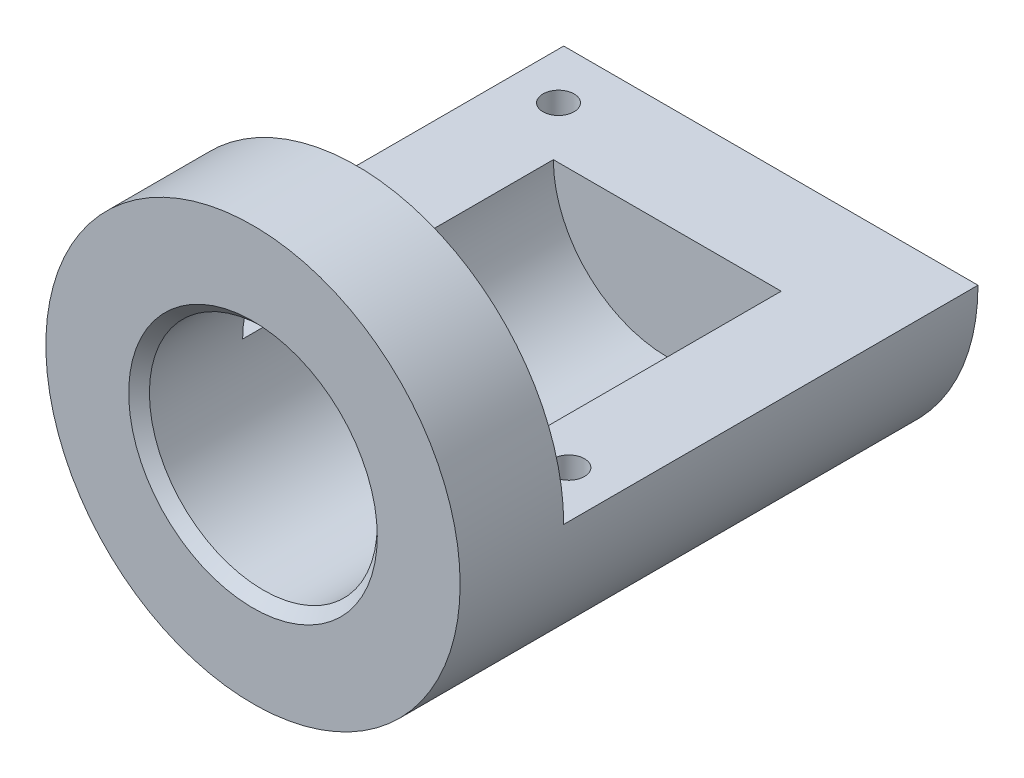
ISO-10303-21;
HEADER;
FILE_DESCRIPTION(('STEP AP214'),'2;1');
FILE_NAME('part.step','',(''),(''),'','','');
FILE_SCHEMA(('AUTOMOTIVE_DESIGN { 1 0 10303 214 1 1 1 1 }'));
ENDSEC;
DATA;
#1=APPLICATION_CONTEXT('core data for automotive mechanical design processes');
#2=APPLICATION_PROTOCOL_DEFINITION('international standard','automotive_design',2000,#1);
#3=PRODUCT_CONTEXT('',#1,'mechanical');
#4=PRODUCT('Part','Part','',(#3));
#5=PRODUCT_RELATED_PRODUCT_CATEGORY('part','',(#4));
#6=PRODUCT_DEFINITION_FORMATION('','',#4);
#7=PRODUCT_DEFINITION_CONTEXT('part definition',#1,'design');
#8=PRODUCT_DEFINITION('design','',#6,#7);
#9=PRODUCT_DEFINITION_SHAPE('','',#8);
#10=(LENGTH_UNIT() NAMED_UNIT(*) SI_UNIT(.MILLI.,.METRE.));
#11=(NAMED_UNIT(*) PLANE_ANGLE_UNIT() SI_UNIT($,.RADIAN.));
#12=(NAMED_UNIT(*) SI_UNIT($,.STERADIAN.) SOLID_ANGLE_UNIT());
#13=UNCERTAINTY_MEASURE_WITH_UNIT(LENGTH_MEASURE(1.E-05),#10,'distance_accuracy_value','');
#14=(GEOMETRIC_REPRESENTATION_CONTEXT(3) GLOBAL_UNCERTAINTY_ASSIGNED_CONTEXT((#13)) GLOBAL_UNIT_ASSIGNED_CONTEXT((#10,
#11,#12)) REPRESENTATION_CONTEXT('',''));
#15=CARTESIAN_POINT('',(0.,0.,0.));
#16=DIRECTION('',(0.,0.,1.));
#17=DIRECTION('',(1.,0.,0.));
#18=AXIS2_PLACEMENT_3D('',#15,#16,#17);
#19=CARTESIAN_POINT('',(0.,0.,0.));
#20=DIRECTION('',(0.,0.,1.));
#21=DIRECTION('',(-1.,0.,0.));
#22=AXIS2_PLACEMENT_3D('',#19,#20,#21);
#23=CONICAL_SURFACE('',#22,12.,0.785398163397449);
#24=CARTESIAN_POINT('',(0.,0.,0.));
#25=DIRECTION('',(0.,0.,1.));
#26=DIRECTION('',(1.,0.,0.));
#27=AXIS2_PLACEMENT_3D('',#24,#25,#26);
#28=CIRCLE('',#27,12.);
#29=CARTESIAN_POINT('',(12.,0.,0.));
#30=VERTEX_POINT('',#29);
#31=EDGE_CURVE('E58',#30,#30,#28,.T.);
#32=ORIENTED_EDGE('',*,*,#31,.T.);
#33=EDGE_LOOP('',(#32));
#34=FACE_BOUND('',#33,.T.);
#35=CARTESIAN_POINT('',(0.,0.,-0.999999999999999));
#36=DIRECTION('',(0.,0.,1.));
#37=DIRECTION('',(1.,0.,0.));
#38=AXIS2_PLACEMENT_3D('',#35,#36,#37);
#39=CIRCLE('',#38,11.);
#40=CARTESIAN_POINT('',(11.,0.,-0.999999999999999));
#41=VERTEX_POINT('',#40);
#42=EDGE_CURVE('E12',#41,#41,#39,.F.);
#43=ORIENTED_EDGE('',*,*,#42,.T.);
#44=EDGE_LOOP('',(#43));
#45=FACE_BOUND('',#44,.T.);
#46=ADVANCED_FACE('F51',(#34,#45),#23,.F.);
#47=CARTESIAN_POINT('',(0.,0.,-10.));
#48=DIRECTION('',(0.,0.,1.));
#49=DIRECTION('',(-1.,0.,0.));
#50=AXIS2_PLACEMENT_3D('',#47,#48,#49);
#51=CYLINDRICAL_SURFACE('',#50,11.);
#52=ORIENTED_EDGE('',*,*,#42,.F.);
#53=EDGE_LOOP('',(#52));
#54=FACE_BOUND('',#53,.T.);
#55=DIRECTION('',(0.,0.,1.));
#56=VECTOR('',#55,1.);
#57=CARTESIAN_POINT('',(-11.,0.,-50.));
#58=LINE('',#57,#56);
#59=CARTESIAN_POINT('',(-11.,0.,-40.));
#60=VERTEX_POINT('',#59);
#61=CARTESIAN_POINT('',(-11.,0.,-10.));
#62=VERTEX_POINT('',#61);
#63=EDGE_CURVE('E98',#60,#62,#58,.T.);
#64=ORIENTED_EDGE('',*,*,#63,.T.);
#65=CARTESIAN_POINT('',(0.,0.,-10.));
#66=DIRECTION('',(0.,0.,1.));
#67=DIRECTION('',(1.,0.,0.));
#68=AXIS2_PLACEMENT_3D('',#65,#66,#67);
#69=CIRCLE('',#68,11.);
#70=CARTESIAN_POINT('',(11.,0.,-10.));
#71=VERTEX_POINT('',#70);
#72=EDGE_CURVE('E109',#71,#62,#69,.T.);
#73=ORIENTED_EDGE('',*,*,#72,.F.);
#74=DIRECTION('',(0.,0.,1.));
#75=VECTOR('',#74,1.);
#76=CARTESIAN_POINT('',(11.,0.,-50.));
#77=LINE('',#76,#75);
#78=CARTESIAN_POINT('',(11.,0.,-40.));
#79=VERTEX_POINT('',#78);
#80=EDGE_CURVE('E95',#79,#71,#77,.T.);
#81=ORIENTED_EDGE('',*,*,#80,.F.);
#82=CARTESIAN_POINT('',(0.,0.,-40.));
#83=DIRECTION('',(0.,0.,1.));
#84=DIRECTION('',(1.,0.,0.));
#85=AXIS2_PLACEMENT_3D('',#82,#83,#84);
#86=CIRCLE('',#85,11.);
#87=EDGE_CURVE('E101',#60,#79,#86,.T.);
#88=ORIENTED_EDGE('',*,*,#87,.F.);
#89=EDGE_LOOP('',(#64,#73,#81,#88));
#90=FACE_BOUND('',#89,.T.);
#91=ADVANCED_FACE('F108',(#54,#90),#51,.F.);
#92=CARTESIAN_POINT('',(0.,0.,-10.));
#93=DIRECTION('',(0.,0.,-1.));
#94=DIRECTION('',(1.,0.,0.));
#95=AXIS2_PLACEMENT_3D('',#92,#93,#94);
#96=PLANE('',#95);
#97=DIRECTION('',(-1.,0.,0.));
#98=VECTOR('',#97,1.);
#99=CARTESIAN_POINT('',(-20.,0.,-10.));
#100=LINE('',#99,#98);
#101=CARTESIAN_POINT('',(-20.,0.,-10.));
#102=VERTEX_POINT('',#101);
#103=EDGE_CURVE('E65',#62,#102,#100,.T.);
#104=ORIENTED_EDGE('',*,*,#103,.T.);
#105=CARTESIAN_POINT('',(0.,0.,-10.));
#106=DIRECTION('',(0.,0.,1.));
#107=DIRECTION('',(1.,0.,0.));
#108=AXIS2_PLACEMENT_3D('',#105,#106,#107);
#109=CIRCLE('',#108,20.);
#110=CARTESIAN_POINT('',(20.,0.,-10.));
#111=VERTEX_POINT('',#110);
#112=EDGE_CURVE('E118',#111,#102,#109,.T.);
#113=ORIENTED_EDGE('',*,*,#112,.F.);
#114=DIRECTION('',(-1.,0.,0.));
#115=VECTOR('',#114,1.);
#116=CARTESIAN_POINT('',(11.,0.,-10.));
#117=LINE('',#116,#115);
#118=EDGE_CURVE('E106',#111,#71,#117,.T.);
#119=ORIENTED_EDGE('',*,*,#118,.T.);
#120=ORIENTED_EDGE('',*,*,#72,.T.);
#121=EDGE_LOOP('',(#104,#113,#119,#120));
#122=FACE_BOUND('',#121,.T.);
#123=ADVANCED_FACE('F130',(#122),#96,.T.);
#124=CARTESIAN_POINT('',(0.,0.,0.));
#125=DIRECTION('',(0.,0.,-1.));
#126=DIRECTION('',(1.,0.,0.));
#127=AXIS2_PLACEMENT_3D('',#124,#125,#126);
#128=PLANE('',#127);
#129=ORIENTED_EDGE('',*,*,#31,.F.);
#130=EDGE_LOOP('',(#129));
#131=FACE_BOUND('',#130,.T.);
#132=CARTESIAN_POINT('',(0.,0.,0.));
#133=DIRECTION('',(0.,0.,1.));
#134=DIRECTION('',(1.,0.,0.));
#135=AXIS2_PLACEMENT_3D('',#132,#133,#134);
#136=CIRCLE('',#135,20.);
#137=CARTESIAN_POINT('',(20.,0.,0.));
#138=VERTEX_POINT('',#137);
#139=EDGE_CURVE('E117',#138,#138,#136,.T.);
#140=ORIENTED_EDGE('',*,*,#139,.T.);
#141=EDGE_LOOP('',(#140));
#142=FACE_BOUND('',#141,.T.);
#143=ADVANCED_FACE('F126',(#131,#142),#128,.F.);
#144=CARTESIAN_POINT('',(0.,0.,-10.));
#145=DIRECTION('',(0.,0.,1.));
#146=DIRECTION('',(-1.,0.,0.));
#147=AXIS2_PLACEMENT_3D('',#144,#145,#146);
#148=CYLINDRICAL_SURFACE('',#147,20.);
#149=DIRECTION('',(0.,0.,1.));
#150=VECTOR('',#149,1.);
#151=CARTESIAN_POINT('',(-20.,0.,-50.));
#152=LINE('',#151,#150);
#153=CARTESIAN_POINT('',(-20.,0.,-50.));
#154=VERTEX_POINT('',#153);
#155=EDGE_CURVE('E70',#154,#102,#152,.T.);
#156=ORIENTED_EDGE('',*,*,#155,.F.);
#157=CARTESIAN_POINT('',(0.,0.,-50.));
#158=DIRECTION('',(0.,0.,1.));
#159=DIRECTION('',(1.,0.,0.));
#160=AXIS2_PLACEMENT_3D('',#157,#158,#159);
#161=CIRCLE('',#160,20.);
#162=CARTESIAN_POINT('',(20.,0.,-50.));
#163=VERTEX_POINT('',#162);
#164=EDGE_CURVE('E207',#154,#163,#161,.T.);
#165=ORIENTED_EDGE('',*,*,#164,.T.);
#166=DIRECTION('',(0.,0.,1.));
#167=VECTOR('',#166,1.);
#168=CARTESIAN_POINT('',(20.,0.,-50.));
#169=LINE('',#168,#167);
#170=EDGE_CURVE('E110',#163,#111,#169,.T.);
#171=ORIENTED_EDGE('',*,*,#170,.T.);
#172=ORIENTED_EDGE('',*,*,#112,.T.);
#173=EDGE_LOOP('',(#156,#165,#171,#172));
#174=FACE_BOUND('',#173,.T.);
#175=ORIENTED_EDGE('',*,*,#139,.F.);
#176=EDGE_LOOP('',(#175));
#177=FACE_BOUND('',#176,.T.);
#178=ADVANCED_FACE('F129',(#174,#177),#148,.T.);
#179=CARTESIAN_POINT('',(11.,0.,-50.));
#180=DIRECTION('',(0.,-1.,0.));
#181=DIRECTION('',(0.,0.,1.));
#182=AXIS2_PLACEMENT_3D('',#179,#180,#181);
#183=PLANE('',#182);
#184=CARTESIAN_POINT('',(-15.5,0.,-45.));
#185=DIRECTION('',(0.,-1.,0.));
#186=DIRECTION('',(0.,0.,-1.));
#187=AXIS2_PLACEMENT_3D('',#184,#185,#186);
#188=CIRCLE('',#187,1.5000000000041);
#189=CARTESIAN_POINT('',(-15.5,0.,-46.5000000000041));
#190=VERTEX_POINT('',#189);
#191=EDGE_CURVE('E197',#190,#190,#188,.T.);
#192=ORIENTED_EDGE('',*,*,#191,.T.);
#193=EDGE_LOOP('',(#192));
#194=FACE_BOUND('',#193,.T.);
#195=CARTESIAN_POINT('',(15.5,0.,-15.));
#196=DIRECTION('',(0.,-1.,0.));
#197=DIRECTION('',(0.,0.,-1.));
#198=AXIS2_PLACEMENT_3D('',#195,#196,#197);
#199=CIRCLE('',#198,1.50000000000409);
#200=CARTESIAN_POINT('',(15.5,0.,-16.5000000000041));
#201=VERTEX_POINT('',#200);
#202=EDGE_CURVE('E191',#201,#201,#199,.T.);
#203=ORIENTED_EDGE('',*,*,#202,.T.);
#204=EDGE_LOOP('',(#203));
#205=FACE_BOUND('',#204,.T.);
#206=CARTESIAN_POINT('',(-15.5,0.,-15.));
#207=DIRECTION('',(0.,-1.,0.));
#208=DIRECTION('',(0.,0.,-1.));
#209=AXIS2_PLACEMENT_3D('',#206,#207,#208);
#210=CIRCLE('',#209,1.5000000000041);
#211=CARTESIAN_POINT('',(-15.5,0.,-16.5000000000041));
#212=VERTEX_POINT('',#211);
#213=EDGE_CURVE('E193',#212,#212,#210,.T.);
#214=ORIENTED_EDGE('',*,*,#213,.T.);
#215=EDGE_LOOP('',(#214));
#216=FACE_BOUND('',#215,.T.);
#217=ORIENTED_EDGE('',*,*,#170,.F.);
#218=DIRECTION('',(-1.,0.,0.));
#219=VECTOR('',#218,1.);
#220=CARTESIAN_POINT('',(11.,0.,-50.));
#221=LINE('',#220,#219);
#222=EDGE_CURVE('E210',#163,#154,#221,.T.);
#223=ORIENTED_EDGE('',*,*,#222,.T.);
#224=ORIENTED_EDGE('',*,*,#155,.T.);
#225=ORIENTED_EDGE('',*,*,#103,.F.);
#226=ORIENTED_EDGE('',*,*,#63,.F.);
#227=DIRECTION('',(-1.,0.,0.));
#228=VECTOR('',#227,1.);
#229=CARTESIAN_POINT('',(-20.,0.,-40.));
#230=LINE('',#229,#228);
#231=EDGE_CURVE('E89',#79,#60,#230,.T.);
#232=ORIENTED_EDGE('',*,*,#231,.F.);
#233=ORIENTED_EDGE('',*,*,#80,.T.);
#234=ORIENTED_EDGE('',*,*,#118,.F.);
#235=EDGE_LOOP('',(#217,#223,#224,#225,#226,#232,#233,#234));
#236=FACE_BOUND('',#235,.T.);
#237=ADVANCED_FACE('F92',(#194,#205,#216,#236),#183,.F.);
#238=CARTESIAN_POINT('',(0.,0.,-50.));
#239=DIRECTION('',(0.,0.,-1.));
#240=DIRECTION('',(1.,0.,0.));
#241=AXIS2_PLACEMENT_3D('',#238,#239,#240);
#242=PLANE('',#241);
#243=ORIENTED_EDGE('',*,*,#164,.F.);
#244=ORIENTED_EDGE('',*,*,#222,.F.);
#245=EDGE_LOOP('',(#243,#244));
#246=FACE_BOUND('',#245,.T.);
#247=ADVANCED_FACE('F139',(#246),#242,.T.);
#248=CARTESIAN_POINT('',(0.,0.,-40.));
#249=DIRECTION('',(0.,0.,-1.));
#250=DIRECTION('',(1.,0.,0.));
#251=AXIS2_PLACEMENT_3D('',#248,#249,#250);
#252=PLANE('',#251);
#253=ORIENTED_EDGE('',*,*,#87,.T.);
#254=ORIENTED_EDGE('',*,*,#231,.T.);
#255=EDGE_LOOP('',(#253,#254));
#256=FACE_BOUND('',#255,.T.);
#257=ADVANCED_FACE('F104',(#256),#252,.F.);
#258=CARTESIAN_POINT('',(-15.5,-8.,-15.));
#259=DIRECTION('',(0.,1.,0.));
#260=DIRECTION('',(0.,0.,-1.));
#261=AXIS2_PLACEMENT_3D('',#258,#259,#260);
#262=CYLINDRICAL_SURFACE('',#261,1.5000000000041);
#263=CARTESIAN_POINT('',(-15.5,-8.,-15.));
#264=DIRECTION('',(0.,-1.,0.));
#265=DIRECTION('',(0.,0.,-1.));
#266=AXIS2_PLACEMENT_3D('',#263,#264,#265);
#267=CIRCLE('',#266,1.5000000000041);
#268=CARTESIAN_POINT('',(-15.5,-8.,-16.5000000000041));
#269=VERTEX_POINT('',#268);
#270=EDGE_CURVE('E102',#269,#269,#267,.T.);
#271=ORIENTED_EDGE('',*,*,#270,.T.);
#272=EDGE_LOOP('',(#271));
#273=FACE_BOUND('',#272,.T.);
#274=ORIENTED_EDGE('',*,*,#213,.F.);
#275=EDGE_LOOP('',(#274));
#276=FACE_BOUND('',#275,.T.);
#277=ADVANCED_FACE('F160',(#273,#276),#262,.F.);
#278=CARTESIAN_POINT('',(-15.5,-8.,-15.));
#279=DIRECTION('',(0.,1.,0.));
#280=DIRECTION('',(0.,0.,-1.));
#281=AXIS2_PLACEMENT_3D('',#278,#279,#280);
#282=PLANE('',#281);
#283=ORIENTED_EDGE('',*,*,#270,.F.);
#284=EDGE_LOOP('',(#283));
#285=FACE_BOUND('',#284,.T.);
#286=ADVANCED_FACE('F163',(#285),#282,.T.);
#287=CARTESIAN_POINT('',(15.5,-8.,-15.));
#288=DIRECTION('',(0.,1.,0.));
#289=DIRECTION('',(0.,0.,-1.));
#290=AXIS2_PLACEMENT_3D('',#287,#288,#289);
#291=CYLINDRICAL_SURFACE('',#290,1.50000000000409);
#292=CARTESIAN_POINT('',(15.5,-8.,-15.));
#293=DIRECTION('',(0.,-1.,0.));
#294=DIRECTION('',(0.,0.,-1.));
#295=AXIS2_PLACEMENT_3D('',#292,#293,#294);
#296=CIRCLE('',#295,1.50000000000409);
#297=CARTESIAN_POINT('',(15.5,-8.,-16.5000000000041));
#298=VERTEX_POINT('',#297);
#299=EDGE_CURVE('E188',#298,#298,#296,.T.);
#300=ORIENTED_EDGE('',*,*,#299,.T.);
#301=EDGE_LOOP('',(#300));
#302=FACE_BOUND('',#301,.T.);
#303=ORIENTED_EDGE('',*,*,#202,.F.);
#304=EDGE_LOOP('',(#303));
#305=FACE_BOUND('',#304,.T.);
#306=ADVANCED_FACE('F167',(#302,#305),#291,.F.);
#307=CARTESIAN_POINT('',(15.5,-8.,-15.));
#308=DIRECTION('',(0.,1.,0.));
#309=DIRECTION('',(0.,0.,-1.));
#310=AXIS2_PLACEMENT_3D('',#307,#308,#309);
#311=PLANE('',#310);
#312=ORIENTED_EDGE('',*,*,#299,.F.);
#313=EDGE_LOOP('',(#312));
#314=FACE_BOUND('',#313,.T.);
#315=ADVANCED_FACE('F176',(#314),#311,.T.);
#316=CARTESIAN_POINT('',(-15.5,-8.,-45.));
#317=DIRECTION('',(0.,1.,0.));
#318=DIRECTION('',(0.,0.,-1.));
#319=AXIS2_PLACEMENT_3D('',#316,#317,#318);
#320=CYLINDRICAL_SURFACE('',#319,1.5000000000041);
#321=CARTESIAN_POINT('',(-15.5,-8.,-45.));
#322=DIRECTION('',(0.,-1.,0.));
#323=DIRECTION('',(0.,0.,-1.));
#324=AXIS2_PLACEMENT_3D('',#321,#322,#323);
#325=CIRCLE('',#324,1.5000000000041);
#326=CARTESIAN_POINT('',(-15.5,-8.,-46.5000000000041));
#327=VERTEX_POINT('',#326);
#328=EDGE_CURVE('E202',#327,#327,#325,.T.);
#329=ORIENTED_EDGE('',*,*,#328,.T.);
#330=EDGE_LOOP('',(#329));
#331=FACE_BOUND('',#330,.T.);
#332=ORIENTED_EDGE('',*,*,#191,.F.);
#333=EDGE_LOOP('',(#332));
#334=FACE_BOUND('',#333,.T.);
#335=ADVANCED_FACE('F172',(#331,#334),#320,.F.);
#336=CARTESIAN_POINT('',(-15.5,-8.,-45.));
#337=DIRECTION('',(0.,1.,0.));
#338=DIRECTION('',(0.,0.,-1.));
#339=AXIS2_PLACEMENT_3D('',#336,#337,#338);
#340=PLANE('',#339);
#341=ORIENTED_EDGE('',*,*,#328,.F.);
#342=EDGE_LOOP('',(#341));
#343=FACE_BOUND('',#342,.T.);
#344=ADVANCED_FACE('F169',(#343),#340,.T.);
#345=CLOSED_SHELL('',(#46,#91,#123,#143,#178,#237,#247,#257,#277,#286,#306,#315,#335,#344));
#346=MANIFOLD_SOLID_BREP('B2',#345);
#347=ADVANCED_BREP_SHAPE_REPRESENTATION('',(#18,#346),#14);
#348=SHAPE_DEFINITION_REPRESENTATION(#9,#347);
ENDSEC;
END-ISO-10303-21;
